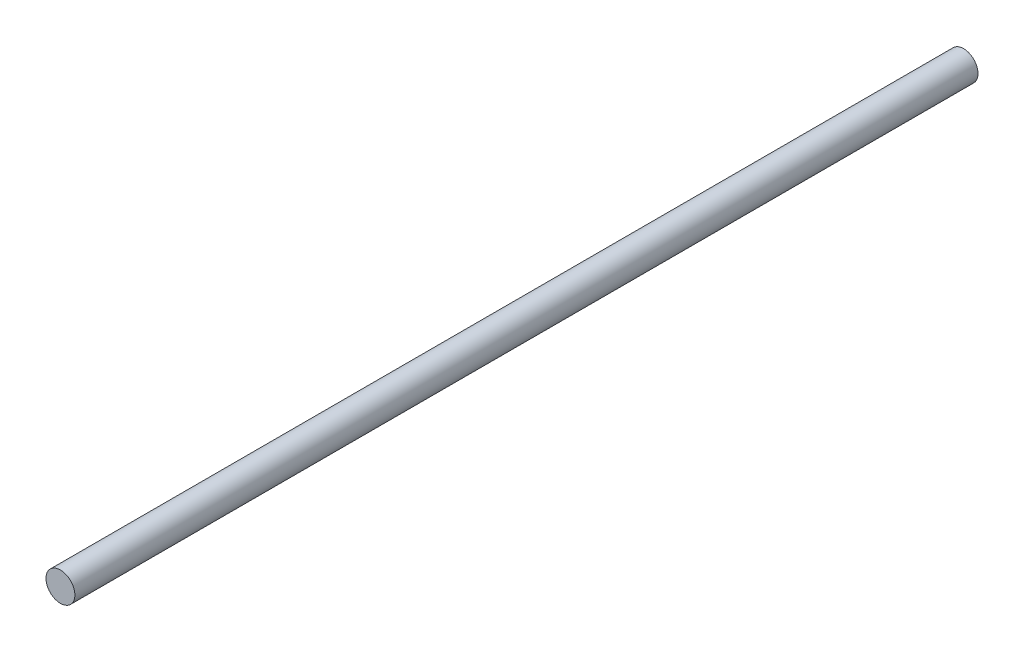
ISO-10303-21;
HEADER;
FILE_DESCRIPTION(('STEP AP214'),'2;1');
FILE_NAME('part.step','',(''),(''),'','','');
FILE_SCHEMA(('AUTOMOTIVE_DESIGN { 1 0 10303 214 1 1 1 1 }'));
ENDSEC;
DATA;
#1=APPLICATION_CONTEXT('core data for automotive mechanical design processes');
#2=APPLICATION_PROTOCOL_DEFINITION('international standard','automotive_design',2000,#1);
#3=PRODUCT_CONTEXT('',#1,'mechanical');
#4=PRODUCT('Part','Part','',(#3));
#5=PRODUCT_RELATED_PRODUCT_CATEGORY('part','',(#4));
#6=PRODUCT_DEFINITION_FORMATION('','',#4);
#7=PRODUCT_DEFINITION_CONTEXT('part definition',#1,'design');
#8=PRODUCT_DEFINITION('design','',#6,#7);
#9=PRODUCT_DEFINITION_SHAPE('','',#8);
#10=(LENGTH_UNIT() NAMED_UNIT(*) SI_UNIT(.MILLI.,.METRE.));
#11=(NAMED_UNIT(*) PLANE_ANGLE_UNIT() SI_UNIT($,.RADIAN.));
#12=(NAMED_UNIT(*) SI_UNIT($,.STERADIAN.) SOLID_ANGLE_UNIT());
#13=UNCERTAINTY_MEASURE_WITH_UNIT(LENGTH_MEASURE(1.E-05),#10,'distance_accuracy_value','');
#14=(GEOMETRIC_REPRESENTATION_CONTEXT(3) GLOBAL_UNCERTAINTY_ASSIGNED_CONTEXT((#13)) GLOBAL_UNIT_ASSIGNED_CONTEXT((#10,
#11,#12)) REPRESENTATION_CONTEXT('',''));
#15=CARTESIAN_POINT('',(0.,0.,0.));
#16=DIRECTION('',(0.,0.,1.));
#17=DIRECTION('',(1.,0.,0.));
#18=AXIS2_PLACEMENT_3D('',#15,#16,#17);
#19=CARTESIAN_POINT('',(0.,0.,250.));
#20=DIRECTION('',(0.,0.,1.));
#21=DIRECTION('',(1.,0.,0.));
#22=AXIS2_PLACEMENT_3D('',#19,#20,#21);
#23=PLANE('',#22);
#24=CARTESIAN_POINT('',(0.,0.,250.));
#25=DIRECTION('',(0.,0.,1.));
#26=DIRECTION('',(1.,0.,0.));
#27=AXIS2_PLACEMENT_3D('',#24,#25,#26);
#28=CIRCLE('',#27,4.);
#29=CARTESIAN_POINT('',(4.,0.,250.));
#30=VERTEX_POINT('',#29);
#31=EDGE_CURVE('E18',#30,#30,#28,.F.);
#32=ORIENTED_EDGE('',*,*,#31,.F.);
#33=EDGE_LOOP('',(#32));
#34=FACE_BOUND('',#33,.T.);
#35=ADVANCED_FACE('F15',(#34),#23,.T.);
#36=CARTESIAN_POINT('',(0.,0.,0.));
#37=DIRECTION('',(0.,0.,1.));
#38=DIRECTION('',(1.,0.,0.));
#39=AXIS2_PLACEMENT_3D('',#36,#37,#38);
#40=PLANE('',#39);
#41=CARTESIAN_POINT('',(0.,0.,0.));
#42=DIRECTION('',(0.,0.,1.));
#43=DIRECTION('',(1.,0.,0.));
#44=AXIS2_PLACEMENT_3D('',#41,#42,#43);
#45=CIRCLE('',#44,4.);
#46=CARTESIAN_POINT('',(4.,0.,0.));
#47=VERTEX_POINT('',#46);
#48=EDGE_CURVE('E10',#47,#47,#45,.T.);
#49=ORIENTED_EDGE('',*,*,#48,.F.);
#50=EDGE_LOOP('',(#49));
#51=FACE_BOUND('',#50,.T.);
#52=ADVANCED_FACE('F30',(#51),#40,.F.);
#53=CARTESIAN_POINT('',(0.,0.,0.));
#54=DIRECTION('',(0.,0.,1.));
#55=DIRECTION('',(1.,0.,0.));
#56=AXIS2_PLACEMENT_3D('',#53,#54,#55);
#57=CYLINDRICAL_SURFACE('',#56,4.);
#58=ORIENTED_EDGE('',*,*,#48,.T.);
#59=EDGE_LOOP('',(#58));
#60=FACE_BOUND('',#59,.T.);
#61=ORIENTED_EDGE('',*,*,#31,.T.);
#62=EDGE_LOOP('',(#61));
#63=FACE_BOUND('',#62,.T.);
#64=ADVANCED_FACE('F27',(#60,#63),#57,.T.);
#65=CLOSED_SHELL('',(#35,#52,#64));
#66=MANIFOLD_SOLID_BREP('B1',#65);
#67=ADVANCED_BREP_SHAPE_REPRESENTATION('',(#18,#66),#14);
#68=SHAPE_DEFINITION_REPRESENTATION(#9,#67);
ENDSEC;
END-ISO-10303-21;
